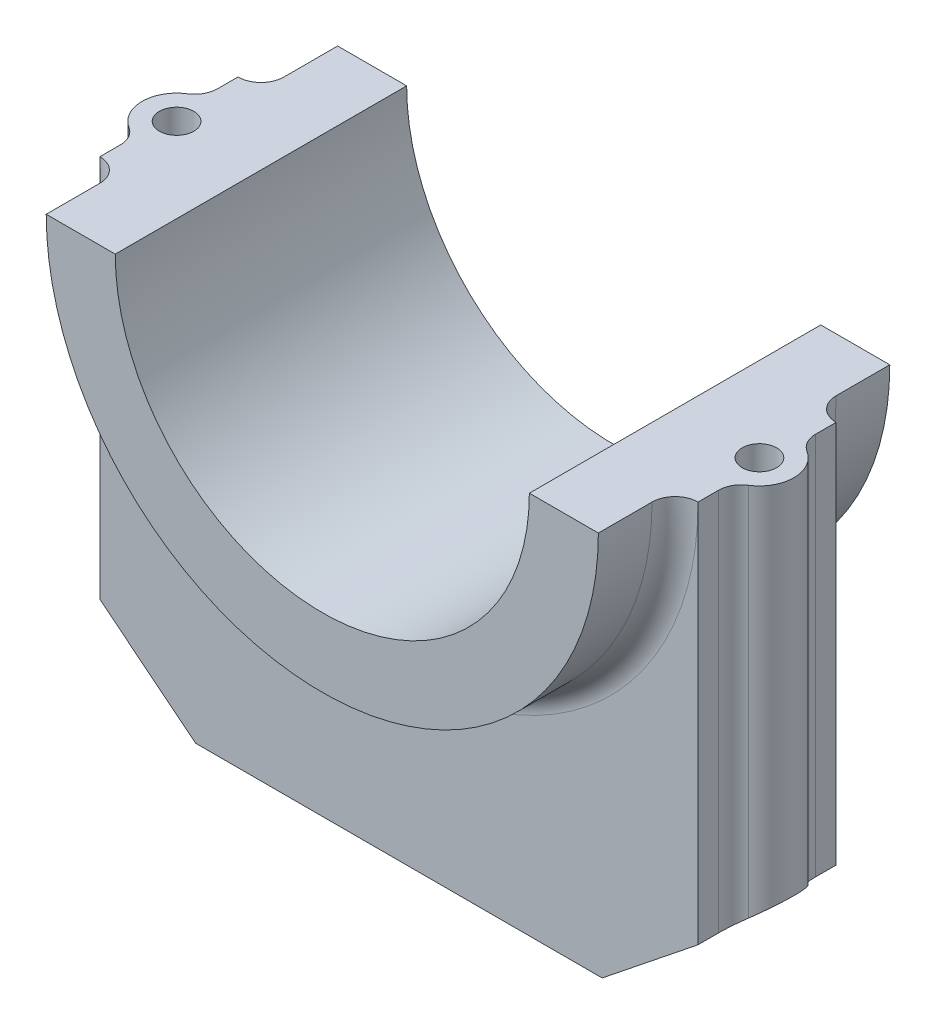
ISO-10303-21;
HEADER;
FILE_DESCRIPTION(('STEP AP214'),'2;1');
FILE_NAME('part.step','',(''),(''),'','','');
FILE_SCHEMA(('AUTOMOTIVE_DESIGN { 1 0 10303 214 1 1 1 1 }'));
ENDSEC;
DATA;
#1=APPLICATION_CONTEXT('core data for automotive mechanical design processes');
#2=APPLICATION_PROTOCOL_DEFINITION('international standard','automotive_design',2000,#1);
#3=PRODUCT_CONTEXT('',#1,'mechanical');
#4=PRODUCT('Part','Part','',(#3));
#5=PRODUCT_RELATED_PRODUCT_CATEGORY('part','',(#4));
#6=PRODUCT_DEFINITION_FORMATION('','',#4);
#7=PRODUCT_DEFINITION_CONTEXT('part definition',#1,'design');
#8=PRODUCT_DEFINITION('design','',#6,#7);
#9=PRODUCT_DEFINITION_SHAPE('','',#8);
#10=(LENGTH_UNIT() NAMED_UNIT(*) SI_UNIT(.MILLI.,.METRE.));
#11=(NAMED_UNIT(*) PLANE_ANGLE_UNIT() SI_UNIT($,.RADIAN.));
#12=(NAMED_UNIT(*) SI_UNIT($,.STERADIAN.) SOLID_ANGLE_UNIT());
#13=UNCERTAINTY_MEASURE_WITH_UNIT(LENGTH_MEASURE(1.E-05),#10,'distance_accuracy_value','');
#14=(GEOMETRIC_REPRESENTATION_CONTEXT(3) GLOBAL_UNCERTAINTY_ASSIGNED_CONTEXT((#13)) GLOBAL_UNIT_ASSIGNED_CONTEXT((#10,
#11,#12)) REPRESENTATION_CONTEXT('',''));
#15=CARTESIAN_POINT('',(0.,0.,0.));
#16=DIRECTION('',(0.,0.,1.));
#17=DIRECTION('',(1.,0.,0.));
#18=AXIS2_PLACEMENT_3D('',#15,#16,#17);
#19=CARTESIAN_POINT('',(0.,0.,19.));
#20=DIRECTION('',(0.,-1.,0.));
#21=DIRECTION('',(0.,0.,-1.));
#22=AXIS2_PLACEMENT_3D('',#19,#20,#21);
#23=PLANE('',#22);
#24=CARTESIAN_POINT('',(38.,0.,0.));
#25=DIRECTION('',(0.,1.,0.));
#26=DIRECTION('',(0.,0.,1.));
#27=AXIS2_PLACEMENT_3D('',#24,#25,#26);
#28=CIRCLE('',#27,2.25);
#29=CARTESIAN_POINT('',(38.,0.,2.25));
#30=VERTEX_POINT('',#29);
#31=EDGE_CURVE('E319',#30,#30,#28,.F.);
#32=ORIENTED_EDGE('',*,*,#31,.T.);
#33=EDGE_LOOP('',(#32));
#34=FACE_BOUND('',#33,.T.);
#35=DIRECTION('',(0.,0.,1.));
#36=VECTOR('',#35,1.);
#37=CARTESIAN_POINT('',(39.,0.,0.));
#38=LINE('',#37,#36);
#39=CARTESIAN_POINT('',(39.,0.,6.34428877022476));
#40=VERTEX_POINT('',#39);
#41=CARTESIAN_POINT('',(39.,0.,9.));
#42=VERTEX_POINT('',#41);
#43=EDGE_CURVE('E215',#40,#42,#38,.T.);
#44=ORIENTED_EDGE('',*,*,#43,.F.);
#45=CARTESIAN_POINT('',(42.,0.,6.34428877022476));
#46=DIRECTION('',(0.,-1.,0.));
#47=DIRECTION('',(0.,0.,-1.));
#48=AXIS2_PLACEMENT_3D('',#45,#46,#47);
#49=CIRCLE('',#48,3.);
#50=CARTESIAN_POINT('',(40.4,0.,3.80657326213485));
#51=VERTEX_POINT('',#50);
#52=EDGE_CURVE('E289',#40,#51,#49,.T.);
#53=ORIENTED_EDGE('',*,*,#52,.T.);
#54=CARTESIAN_POINT('',(38.,0.,0.));
#55=DIRECTION('',(0.,1.,0.));
#56=DIRECTION('',(0.,0.,1.));
#57=AXIS2_PLACEMENT_3D('',#54,#55,#56);
#58=CIRCLE('',#57,4.5);
#59=CARTESIAN_POINT('',(40.4,0.,-3.80657326213485));
#60=VERTEX_POINT('',#59);
#61=EDGE_CURVE('E225',#51,#60,#58,.T.);
#62=ORIENTED_EDGE('',*,*,#61,.T.);
#63=CARTESIAN_POINT('',(42.,0.,-6.34428877022476));
#64=DIRECTION('',(0.,-1.,0.));
#65=DIRECTION('',(0.,0.,-1.));
#66=AXIS2_PLACEMENT_3D('',#63,#64,#65);
#67=CIRCLE('',#66,3.);
#68=CARTESIAN_POINT('',(39.,0.,-6.34428877022476));
#69=VERTEX_POINT('',#68);
#70=EDGE_CURVE('E87',#60,#69,#67,.T.);
#71=ORIENTED_EDGE('',*,*,#70,.T.);
#72=CARTESIAN_POINT('',(39.,0.,-9.));
#73=VERTEX_POINT('',#72);
#74=EDGE_CURVE('E224',#73,#69,#38,.T.);
#75=ORIENTED_EDGE('',*,*,#74,.F.);
#76=CARTESIAN_POINT('',(39.,0.,-12.));
#77=DIRECTION('',(0.,-1.,0.));
#78=DIRECTION('',(0.,0.,-1.));
#79=AXIS2_PLACEMENT_3D('',#76,#77,#78);
#80=CIRCLE('',#79,3.);
#81=CARTESIAN_POINT('',(36.,0.,-12.));
#82=VERTEX_POINT('',#81);
#83=EDGE_CURVE('E262',#73,#82,#80,.T.);
#84=ORIENTED_EDGE('',*,*,#83,.T.);
#85=DIRECTION('',(0.,0.,-1.));
#86=VECTOR('',#85,1.);
#87=CARTESIAN_POINT('',(36.,0.,19.));
#88=LINE('',#87,#86);
#89=CARTESIAN_POINT('',(36.,0.,-19.));
#90=VERTEX_POINT('',#89);
#91=EDGE_CURVE('E387',#82,#90,#88,.T.);
#92=ORIENTED_EDGE('',*,*,#91,.T.);
#93=DIRECTION('',(-1.,0.,0.));
#94=VECTOR('',#93,1.);
#95=CARTESIAN_POINT('',(0.,0.,-19.));
#96=LINE('',#95,#94);
#97=CARTESIAN_POINT('',(27.,0.,-19.));
#98=VERTEX_POINT('',#97);
#99=EDGE_CURVE('E372',#90,#98,#96,.T.);
#100=ORIENTED_EDGE('',*,*,#99,.T.);
#101=DIRECTION('',(0.,0.,-1.));
#102=VECTOR('',#101,1.);
#103=CARTESIAN_POINT('',(27.,0.,19.));
#104=LINE('',#103,#102);
#105=CARTESIAN_POINT('',(27.,0.,19.));
#106=VERTEX_POINT('',#105);
#107=EDGE_CURVE('E384',#106,#98,#104,.T.);
#108=ORIENTED_EDGE('',*,*,#107,.F.);
#109=DIRECTION('',(-1.,0.,0.));
#110=VECTOR('',#109,1.);
#111=CARTESIAN_POINT('',(0.,0.,19.));
#112=LINE('',#111,#110);
#113=CARTESIAN_POINT('',(36.,0.,19.));
#114=VERTEX_POINT('',#113);
#115=EDGE_CURVE('E362',#114,#106,#112,.T.);
#116=ORIENTED_EDGE('',*,*,#115,.F.);
#117=CARTESIAN_POINT('',(36.,0.,12.));
#118=VERTEX_POINT('',#117);
#119=EDGE_CURVE('E242',#114,#118,#88,.T.);
#120=ORIENTED_EDGE('',*,*,#119,.T.);
#121=CARTESIAN_POINT('',(39.,0.,12.));
#122=DIRECTION('',(0.,-1.,0.));
#123=DIRECTION('',(0.,0.,-1.));
#124=AXIS2_PLACEMENT_3D('',#121,#122,#123);
#125=CIRCLE('',#124,3.);
#126=EDGE_CURVE('E240',#118,#42,#125,.T.);
#127=ORIENTED_EDGE('',*,*,#126,.T.);
#128=EDGE_LOOP('',(#44,#53,#62,#71,#75,#84,#92,#100,#108,#116,#120,#127));
#129=FACE_BOUND('',#128,.T.);
#130=ADVANCED_FACE('F79',(#34,#129),#23,.F.);
#131=CARTESIAN_POINT('',(0.,0.,19.));
#132=DIRECTION('',(0.,-1.,0.));
#133=DIRECTION('',(0.,0.,-1.));
#134=AXIS2_PLACEMENT_3D('',#131,#132,#133);
#135=PLANE('',#134);
#136=CARTESIAN_POINT('',(-38.,0.,0.));
#137=DIRECTION('',(0.,1.,0.));
#138=DIRECTION('',(0.,0.,1.));
#139=AXIS2_PLACEMENT_3D('',#136,#137,#138);
#140=CIRCLE('',#139,4.5);
#141=CARTESIAN_POINT('',(-40.4,0.,3.80657326213485));
#142=VERTEX_POINT('',#141);
#143=CARTESIAN_POINT('',(-40.4,0.,-3.80657326213485));
#144=VERTEX_POINT('',#143);
#145=EDGE_CURVE('E328',#142,#144,#140,.F.);
#146=ORIENTED_EDGE('',*,*,#145,.F.);
#147=CARTESIAN_POINT('',(-42.,0.,6.34428877022476));
#148=DIRECTION('',(0.,-1.,0.));
#149=DIRECTION('',(0.,0.,-1.));
#150=AXIS2_PLACEMENT_3D('',#147,#148,#149);
#151=CIRCLE('',#150,3.);
#152=CARTESIAN_POINT('',(-39.,0.,6.34428877022476));
#153=VERTEX_POINT('',#152);
#154=EDGE_CURVE('E285',#142,#153,#151,.T.);
#155=ORIENTED_EDGE('',*,*,#154,.T.);
#156=DIRECTION('',(0.,0.,1.));
#157=VECTOR('',#156,1.);
#158=CARTESIAN_POINT('',(-39.,0.,0.));
#159=LINE('',#158,#157);
#160=CARTESIAN_POINT('',(-39.,0.,9.));
#161=VERTEX_POINT('',#160);
#162=EDGE_CURVE('E326',#153,#161,#159,.T.);
#163=ORIENTED_EDGE('',*,*,#162,.T.);
#164=CARTESIAN_POINT('',(-39.,0.,12.));
#165=DIRECTION('',(0.,-1.,0.));
#166=DIRECTION('',(0.,0.,-1.));
#167=AXIS2_PLACEMENT_3D('',#164,#165,#166);
#168=CIRCLE('',#167,3.);
#169=CARTESIAN_POINT('',(-36.,0.,12.));
#170=VERTEX_POINT('',#169);
#171=EDGE_CURVE('E246',#161,#170,#168,.T.);
#172=ORIENTED_EDGE('',*,*,#171,.T.);
#173=DIRECTION('',(0.,0.,-1.));
#174=VECTOR('',#173,1.);
#175=CARTESIAN_POINT('',(-36.,0.,19.));
#176=LINE('',#175,#174);
#177=CARTESIAN_POINT('',(-36.,0.,19.));
#178=VERTEX_POINT('',#177);
#179=EDGE_CURVE('E378',#178,#170,#176,.T.);
#180=ORIENTED_EDGE('',*,*,#179,.F.);
#181=DIRECTION('',(-1.,0.,0.));
#182=VECTOR('',#181,1.);
#183=CARTESIAN_POINT('',(0.,0.,19.));
#184=LINE('',#183,#182);
#185=CARTESIAN_POINT('',(-27.,0.,19.));
#186=VERTEX_POINT('',#185);
#187=EDGE_CURVE('E367',#186,#178,#184,.T.);
#188=ORIENTED_EDGE('',*,*,#187,.F.);
#189=DIRECTION('',(0.,0.,-1.));
#190=VECTOR('',#189,1.);
#191=CARTESIAN_POINT('',(-27.,0.,19.));
#192=LINE('',#191,#190);
#193=CARTESIAN_POINT('',(-27.,0.,-19.));
#194=VERTEX_POINT('',#193);
#195=EDGE_CURVE('E381',#186,#194,#192,.T.);
#196=ORIENTED_EDGE('',*,*,#195,.T.);
#197=DIRECTION('',(-1.,0.,0.));
#198=VECTOR('',#197,1.);
#199=CARTESIAN_POINT('',(0.,0.,-19.));
#200=LINE('',#199,#198);
#201=CARTESIAN_POINT('',(-36.,0.,-19.));
#202=VERTEX_POINT('',#201);
#203=EDGE_CURVE('E363',#194,#202,#200,.T.);
#204=ORIENTED_EDGE('',*,*,#203,.T.);
#205=CARTESIAN_POINT('',(-36.,0.,-12.));
#206=VERTEX_POINT('',#205);
#207=EDGE_CURVE('E369',#206,#202,#176,.T.);
#208=ORIENTED_EDGE('',*,*,#207,.F.);
#209=CARTESIAN_POINT('',(-39.,0.,-12.));
#210=DIRECTION('',(0.,-1.,0.));
#211=DIRECTION('',(0.,0.,-1.));
#212=AXIS2_PLACEMENT_3D('',#209,#210,#211);
#213=CIRCLE('',#212,3.);
#214=CARTESIAN_POINT('',(-39.,0.,-9.));
#215=VERTEX_POINT('',#214);
#216=EDGE_CURVE('E253',#206,#215,#213,.T.);
#217=ORIENTED_EDGE('',*,*,#216,.T.);
#218=CARTESIAN_POINT('',(-39.,0.,-6.34428877022476));
#219=VERTEX_POINT('',#218);
#220=EDGE_CURVE('E329',#215,#219,#159,.T.);
#221=ORIENTED_EDGE('',*,*,#220,.T.);
#222=CARTESIAN_POINT('',(-42.,0.,-6.34428877022476));
#223=DIRECTION('',(0.,-1.,0.));
#224=DIRECTION('',(0.,0.,-1.));
#225=AXIS2_PLACEMENT_3D('',#222,#223,#224);
#226=CIRCLE('',#225,3.);
#227=EDGE_CURVE('E281',#219,#144,#226,.T.);
#228=ORIENTED_EDGE('',*,*,#227,.T.);
#229=EDGE_LOOP('',(#146,#155,#163,#172,#180,#188,#196,#204,#208,#217,#221,#228));
#230=FACE_BOUND('',#229,.T.);
#231=CARTESIAN_POINT('',(-38.,0.,0.));
#232=DIRECTION('',(0.,1.,0.));
#233=DIRECTION('',(0.,0.,1.));
#234=AXIS2_PLACEMENT_3D('',#231,#232,#233);
#235=CIRCLE('',#234,2.25);
#236=CARTESIAN_POINT('',(-38.,0.,2.25));
#237=VERTEX_POINT('',#236);
#238=EDGE_CURVE('E315',#237,#237,#235,.T.);
#239=ORIENTED_EDGE('',*,*,#238,.F.);
#240=EDGE_LOOP('',(#239));
#241=FACE_BOUND('',#240,.T.);
#242=ADVANCED_FACE('F399',(#230,#241),#135,.F.);
#243=CARTESIAN_POINT('',(-39.609756097561,-49.5121951219512,9.));
#244=DIRECTION('',(0.624695047554424,0.78086880944303,0.));
#245=DIRECTION('',(-0.78086880944303,0.624695047554424,0.));
#246=AXIS2_PLACEMENT_3D('',#243,#244,#245);
#247=PLANE('',#246);
#248=DIRECTION('',(0.,0.,-1.));
#249=VECTOR('',#248,1.);
#250=CARTESIAN_POINT('',(-39.,-50.,0.));
#251=LINE('',#250,#249);
#252=CARTESIAN_POINT('',(-39.,-50.,9.));
#253=VERTEX_POINT('',#252);
#254=CARTESIAN_POINT('',(-39.,-50.,6.34428877022476));
#255=VERTEX_POINT('',#254);
#256=EDGE_CURVE('E323',#253,#255,#251,.T.);
#257=ORIENTED_EDGE('',*,*,#256,.T.);
#258=CARTESIAN_POINT('',(-42.,-47.6,6.34428877022476));
#259=DIRECTION('',(0.624695047554424,0.78086880944303,0.));
#260=DIRECTION('',(-0.780868809443031,0.624695047554424,0.));
#261=AXIS2_PLACEMENT_3D('',#258,#259,#260);
#262=ELLIPSE('',#261,3.84187454245971,3.);
#263=CARTESIAN_POINT('',(-40.4,-48.88,3.80657326213485));
#264=VERTEX_POINT('',#263);
#265=EDGE_CURVE('E287',#255,#264,#262,.T.);
#266=ORIENTED_EDGE('',*,*,#265,.T.);
#267=CARTESIAN_POINT('',(-38.,-50.8,0.));
#268=DIRECTION('',(0.624695047554424,0.78086880944303,0.));
#269=DIRECTION('',(-0.780868809443031,0.624695047554424,0.));
#270=AXIS2_PLACEMENT_3D('',#267,#268,#269);
#271=ELLIPSE('',#270,5.76281181368956,4.5);
#272=CARTESIAN_POINT('',(-40.4,-48.88,-3.80657326213485));
#273=VERTEX_POINT('',#272);
#274=EDGE_CURVE('E335',#273,#264,#271,.T.);
#275=ORIENTED_EDGE('',*,*,#274,.F.);
#276=CARTESIAN_POINT('',(-42.,-47.6,-6.34428877022476));
#277=DIRECTION('',(0.624695047554424,0.78086880944303,0.));
#278=DIRECTION('',(-0.780868809443031,0.624695047554424,0.));
#279=AXIS2_PLACEMENT_3D('',#276,#277,#278);
#280=ELLIPSE('',#279,3.84187454245971,3.);
#281=CARTESIAN_POINT('',(-39.,-50.,-6.34428877022476));
#282=VERTEX_POINT('',#281);
#283=EDGE_CURVE('E283',#273,#282,#280,.T.);
#284=ORIENTED_EDGE('',*,*,#283,.T.);
#285=DIRECTION('',(0.,0.,-1.));
#286=VECTOR('',#285,1.);
#287=CARTESIAN_POINT('',(-39.,-50.,0.));
#288=LINE('',#287,#286);
#289=CARTESIAN_POINT('',(-39.,-50.,-9.));
#290=VERTEX_POINT('',#289);
#291=EDGE_CURVE('E302',#282,#290,#288,.T.);
#292=ORIENTED_EDGE('',*,*,#291,.T.);
#293=DIRECTION('',(0.78086880944303,-0.624695047554424,0.));
#294=VECTOR('',#293,1.);
#295=CARTESIAN_POINT('',(-39.609756097561,-49.5121951219512,-9.));
#296=LINE('',#295,#294);
#297=CARTESIAN_POINT('',(-26.5,-60.,-9.));
#298=VERTEX_POINT('',#297);
#299=EDGE_CURVE('E341',#290,#298,#296,.T.);
#300=ORIENTED_EDGE('',*,*,#299,.T.);
#301=DIRECTION('',(0.,0.,-1.));
#302=VECTOR('',#301,1.);
#303=CARTESIAN_POINT('',(-26.5,-60.,9.));
#304=LINE('',#303,#302);
#305=CARTESIAN_POINT('',(-26.5,-60.,9.));
#306=VERTEX_POINT('',#305);
#307=EDGE_CURVE('E355',#306,#298,#304,.T.);
#308=ORIENTED_EDGE('',*,*,#307,.F.);
#309=DIRECTION('',(0.78086880944303,-0.624695047554424,0.));
#310=VECTOR('',#309,1.);
#311=CARTESIAN_POINT('',(-39.609756097561,-49.5121951219512,9.));
#312=LINE('',#311,#310);
#313=EDGE_CURVE('E342',#253,#306,#312,.T.);
#314=ORIENTED_EDGE('',*,*,#313,.F.);
#315=EDGE_LOOP('',(#257,#266,#275,#284,#292,#300,#308,#314));
#316=FACE_BOUND('',#315,.T.);
#317=CARTESIAN_POINT('',(-38.,-50.8,0.));
#318=DIRECTION('',(0.624695047554424,0.78086880944303,0.));
#319=DIRECTION('',(-0.780868809443031,0.624695047554424,0.));
#320=AXIS2_PLACEMENT_3D('',#317,#318,#319);
#321=ELLIPSE('',#320,2.88140590684478,2.25);
#322=CARTESIAN_POINT('',(-40.25,-49.,0.));
#323=VERTEX_POINT('',#322);
#324=EDGE_CURVE('E318',#323,#323,#321,.F.);
#325=ORIENTED_EDGE('',*,*,#324,.F.);
#326=EDGE_LOOP('',(#325));
#327=FACE_BOUND('',#326,.T.);
#328=ADVANCED_FACE('F427',(#316,#327),#247,.F.);
#329=CARTESIAN_POINT('',(39.609756097561,-49.5121951219512,9.));
#330=DIRECTION('',(-0.624695047554424,0.78086880944303,0.));
#331=DIRECTION('',(-0.78086880944303,-0.624695047554424,0.));
#332=AXIS2_PLACEMENT_3D('',#329,#330,#331);
#333=PLANE('',#332);
#334=CARTESIAN_POINT('',(38.,-50.8,0.));
#335=DIRECTION('',(-0.624695047554424,0.78086880944303,0.));
#336=DIRECTION('',(0.780868809443031,0.624695047554424,0.));
#337=AXIS2_PLACEMENT_3D('',#334,#335,#336);
#338=ELLIPSE('',#337,2.88140590684478,2.25);
#339=CARTESIAN_POINT('',(40.25,-49.,0.));
#340=VERTEX_POINT('',#339);
#341=EDGE_CURVE('E736',#340,#340,#338,.T.);
#342=ORIENTED_EDGE('',*,*,#341,.T.);
#343=EDGE_LOOP('',(#342));
#344=FACE_BOUND('',#343,.T.);
#345=DIRECTION('',(0.78086880944303,0.624695047554424,0.));
#346=VECTOR('',#345,1.);
#347=CARTESIAN_POINT('',(39.609756097561,-49.5121951219512,-9.));
#348=LINE('',#347,#346);
#349=CARTESIAN_POINT('',(26.5,-60.,-9.));
#350=VERTEX_POINT('',#349);
#351=CARTESIAN_POINT('',(39.,-50.,-9.));
#352=VERTEX_POINT('',#351);
#353=EDGE_CURVE('E345',#350,#352,#348,.T.);
#354=ORIENTED_EDGE('',*,*,#353,.T.);
#355=DIRECTION('',(0.,0.,-1.));
#356=VECTOR('',#355,1.);
#357=CARTESIAN_POINT('',(39.,-50.,0.));
#358=LINE('',#357,#356);
#359=CARTESIAN_POINT('',(39.,-50.,-6.34428877022476));
#360=VERTEX_POINT('',#359);
#361=EDGE_CURVE('E309',#360,#352,#358,.T.);
#362=ORIENTED_EDGE('',*,*,#361,.F.);
#363=CARTESIAN_POINT('',(42.,-47.6,-6.34428877022476));
#364=DIRECTION('',(-0.624695047554424,0.78086880944303,0.));
#365=DIRECTION('',(0.780868809443031,0.624695047554424,0.));
#366=AXIS2_PLACEMENT_3D('',#363,#364,#365);
#367=ELLIPSE('',#366,3.84187454245971,3.);
#368=CARTESIAN_POINT('',(40.4,-48.88,-3.80657326213485));
#369=VERTEX_POINT('',#368);
#370=EDGE_CURVE('E12',#360,#369,#367,.T.);
#371=ORIENTED_EDGE('',*,*,#370,.T.);
#372=CARTESIAN_POINT('',(38.,-50.8,0.));
#373=DIRECTION('',(-0.624695047554424,0.78086880944303,0.));
#374=DIRECTION('',(0.780868809443031,0.624695047554424,0.));
#375=AXIS2_PLACEMENT_3D('',#372,#373,#374);
#376=ELLIPSE('',#375,5.76281181368956,4.5);
#377=CARTESIAN_POINT('',(40.4,-48.88,3.80657326213485));
#378=VERTEX_POINT('',#377);
#379=EDGE_CURVE('E299',#369,#378,#376,.F.);
#380=ORIENTED_EDGE('',*,*,#379,.T.);
#381=CARTESIAN_POINT('',(42.,-47.6,6.34428877022476));
#382=DIRECTION('',(-0.624695047554424,0.78086880944303,0.));
#383=DIRECTION('',(0.780868809443031,0.624695047554424,0.));
#384=AXIS2_PLACEMENT_3D('',#381,#382,#383);
#385=ELLIPSE('',#384,3.84187454245971,3.);
#386=CARTESIAN_POINT('',(39.,-50.,6.34428877022476));
#387=VERTEX_POINT('',#386);
#388=EDGE_CURVE('E291',#378,#387,#385,.T.);
#389=ORIENTED_EDGE('',*,*,#388,.T.);
#390=DIRECTION('',(0.,0.,-1.));
#391=VECTOR('',#390,1.);
#392=CARTESIAN_POINT('',(39.,-50.,0.));
#393=LINE('',#392,#391);
#394=CARTESIAN_POINT('',(39.,-50.,9.));
#395=VERTEX_POINT('',#394);
#396=EDGE_CURVE('E297',#395,#387,#393,.T.);
#397=ORIENTED_EDGE('',*,*,#396,.F.);
#398=DIRECTION('',(0.78086880944303,0.624695047554424,0.));
#399=VECTOR('',#398,1.);
#400=CARTESIAN_POINT('',(39.609756097561,-49.5121951219512,9.));
#401=LINE('',#400,#399);
#402=CARTESIAN_POINT('',(26.5,-60.,9.));
#403=VERTEX_POINT('',#402);
#404=EDGE_CURVE('E235',#403,#395,#401,.T.);
#405=ORIENTED_EDGE('',*,*,#404,.F.);
#406=DIRECTION('',(0.,0.,-1.));
#407=VECTOR('',#406,1.);
#408=CARTESIAN_POINT('',(26.5,-60.,9.));
#409=LINE('',#408,#407);
#410=EDGE_CURVE('E348',#403,#350,#409,.T.);
#411=ORIENTED_EDGE('',*,*,#410,.T.);
#412=EDGE_LOOP('',(#354,#362,#371,#380,#389,#397,#405,#411));
#413=FACE_BOUND('',#412,.T.);
#414=ADVANCED_FACE('F296',(#344,#413),#333,.F.);
#415=CARTESIAN_POINT('',(0.,0.,9.));
#416=DIRECTION('',(0.,0.,1.));
#417=DIRECTION('',(1.,0.,0.));
#418=AXIS2_PLACEMENT_3D('',#415,#416,#417);
#419=PLANE('',#418);
#420=DIRECTION('',(0.,1.,0.));
#421=VECTOR('',#420,1.);
#422=CARTESIAN_POINT('',(39.,-60.001,9.));
#423=LINE('',#422,#421);
#424=EDGE_CURVE('E219',#395,#42,#423,.T.);
#425=ORIENTED_EDGE('',*,*,#424,.T.);
#426=CARTESIAN_POINT('',(0.,0.,9.));
#427=DIRECTION('',(0.,0.,1.));
#428=DIRECTION('',(1.,0.,0.));
#429=AXIS2_PLACEMENT_3D('',#426,#427,#428);
#430=CIRCLE('',#429,39.);
#431=EDGE_CURVE('E233',#42,#161,#430,.F.);
#432=ORIENTED_EDGE('',*,*,#431,.T.);
#433=DIRECTION('',(0.,1.,0.));
#434=VECTOR('',#433,1.);
#435=CARTESIAN_POINT('',(-39.,-60.001,9.));
#436=LINE('',#435,#434);
#437=EDGE_CURVE('E332',#253,#161,#436,.T.);
#438=ORIENTED_EDGE('',*,*,#437,.F.);
#439=ORIENTED_EDGE('',*,*,#313,.T.);
#440=DIRECTION('',(1.,0.,0.));
#441=VECTOR('',#440,1.);
#442=CARTESIAN_POINT('',(0.,-60.,9.));
#443=LINE('',#442,#441);
#444=EDGE_CURVE('E344',#306,#403,#443,.T.);
#445=ORIENTED_EDGE('',*,*,#444,.T.);
#446=ORIENTED_EDGE('',*,*,#404,.T.);
#447=EDGE_LOOP('',(#425,#432,#438,#439,#445,#446));
#448=FACE_BOUND('',#447,.T.);
#449=ADVANCED_FACE('F230',(#448),#419,.T.);
#450=CARTESIAN_POINT('',(0.,0.,-9.));
#451=DIRECTION('',(0.,0.,1.));
#452=DIRECTION('',(1.,0.,0.));
#453=AXIS2_PLACEMENT_3D('',#450,#451,#452);
#454=PLANE('',#453);
#455=CARTESIAN_POINT('',(0.,0.,-9.));
#456=DIRECTION('',(0.,0.,1.));
#457=DIRECTION('',(1.,0.,0.));
#458=AXIS2_PLACEMENT_3D('',#455,#456,#457);
#459=CIRCLE('',#458,39.);
#460=EDGE_CURVE('E251',#215,#73,#459,.T.);
#461=ORIENTED_EDGE('',*,*,#460,.T.);
#462=DIRECTION('',(0.,1.,0.));
#463=VECTOR('',#462,1.);
#464=CARTESIAN_POINT('',(39.,-60.001,-9.));
#465=LINE('',#464,#463);
#466=EDGE_CURVE('E236',#352,#73,#465,.T.);
#467=ORIENTED_EDGE('',*,*,#466,.F.);
#468=ORIENTED_EDGE('',*,*,#353,.F.);
#469=DIRECTION('',(1.,0.,0.));
#470=VECTOR('',#469,1.);
#471=CARTESIAN_POINT('',(0.,-60.,-9.));
#472=LINE('',#471,#470);
#473=EDGE_CURVE('E350',#298,#350,#472,.T.);
#474=ORIENTED_EDGE('',*,*,#473,.F.);
#475=ORIENTED_EDGE('',*,*,#299,.F.);
#476=DIRECTION('',(0.,1.,0.));
#477=VECTOR('',#476,1.);
#478=CARTESIAN_POINT('',(-39.,-60.001,-9.));
#479=LINE('',#478,#477);
#480=EDGE_CURVE('E336',#290,#215,#479,.T.);
#481=ORIENTED_EDGE('',*,*,#480,.T.);
#482=EDGE_LOOP('',(#461,#467,#468,#474,#475,#481));
#483=FACE_BOUND('',#482,.T.);
#484=ADVANCED_FACE('F439',(#483),#454,.F.);
#485=CARTESIAN_POINT('',(0.,0.,19.));
#486=DIRECTION('',(0.,0.,-1.));
#487=DIRECTION('',(-1.,0.,0.));
#488=AXIS2_PLACEMENT_3D('',#485,#486,#487);
#489=CYLINDRICAL_SURFACE('',#488,36.);
#490=ORIENTED_EDGE('',*,*,#91,.F.);
#491=CARTESIAN_POINT('',(0.,0.,-12.));
#492=DIRECTION('',(0.,0.,1.));
#493=DIRECTION('',(1.,0.,0.));
#494=AXIS2_PLACEMENT_3D('',#491,#492,#493);
#495=CIRCLE('',#494,36.);
#496=EDGE_CURVE('E256',#82,#206,#495,.F.);
#497=ORIENTED_EDGE('',*,*,#496,.T.);
#498=ORIENTED_EDGE('',*,*,#207,.T.);
#499=CARTESIAN_POINT('',(0.,0.,-19.));
#500=DIRECTION('',(0.,0.,1.));
#501=DIRECTION('',(1.,0.,0.));
#502=AXIS2_PLACEMENT_3D('',#499,#500,#501);
#503=CIRCLE('',#502,36.);
#504=EDGE_CURVE('E358',#90,#202,#503,.F.);
#505=ORIENTED_EDGE('',*,*,#504,.F.);
#506=EDGE_LOOP('',(#490,#497,#498,#505));
#507=FACE_BOUND('',#506,.T.);
#508=ADVANCED_FACE('F393',(#507),#489,.T.);
#509=ORIENTED_EDGE('',*,*,#179,.T.);
#510=CARTESIAN_POINT('',(0.,0.,12.));
#511=DIRECTION('',(0.,0.,1.));
#512=DIRECTION('',(1.,0.,0.));
#513=AXIS2_PLACEMENT_3D('',#510,#511,#512);
#514=CIRCLE('',#513,36.);
#515=EDGE_CURVE('E250',#170,#118,#514,.T.);
#516=ORIENTED_EDGE('',*,*,#515,.T.);
#517=ORIENTED_EDGE('',*,*,#119,.F.);
#518=CARTESIAN_POINT('',(0.,0.,19.));
#519=DIRECTION('',(0.,0.,1.));
#520=DIRECTION('',(1.,0.,0.));
#521=AXIS2_PLACEMENT_3D('',#518,#519,#520);
#522=CIRCLE('',#521,36.);
#523=EDGE_CURVE('E359',#114,#178,#522,.F.);
#524=ORIENTED_EDGE('',*,*,#523,.T.);
#525=EDGE_LOOP('',(#509,#516,#517,#524));
#526=FACE_BOUND('',#525,.T.);
#527=ADVANCED_FACE('F419',(#526),#489,.T.);
#528=CARTESIAN_POINT('',(0.,0.,19.));
#529=DIRECTION('',(0.,0.,-1.));
#530=DIRECTION('',(-1.,0.,0.));
#531=AXIS2_PLACEMENT_3D('',#528,#529,#530);
#532=CYLINDRICAL_SURFACE('',#531,27.);
#533=CARTESIAN_POINT('',(0.,0.,-19.));
#534=DIRECTION('',(0.,0.,1.));
#535=DIRECTION('',(1.,0.,0.));
#536=AXIS2_PLACEMENT_3D('',#533,#534,#535);
#537=CIRCLE('',#536,27.);
#538=EDGE_CURVE('E374',#98,#194,#537,.F.);
#539=ORIENTED_EDGE('',*,*,#538,.T.);
#540=ORIENTED_EDGE('',*,*,#195,.F.);
#541=CARTESIAN_POINT('',(0.,0.,19.));
#542=DIRECTION('',(0.,0.,1.));
#543=DIRECTION('',(1.,0.,0.));
#544=AXIS2_PLACEMENT_3D('',#541,#542,#543);
#545=CIRCLE('',#544,27.);
#546=EDGE_CURVE('E365',#106,#186,#545,.F.);
#547=ORIENTED_EDGE('',*,*,#546,.F.);
#548=ORIENTED_EDGE('',*,*,#107,.T.);
#549=EDGE_LOOP('',(#539,#540,#547,#548));
#550=FACE_BOUND('',#549,.T.);
#551=ADVANCED_FACE('F413',(#550),#532,.F.);
#552=CARTESIAN_POINT('',(0.,0.,19.));
#553=DIRECTION('',(0.,0.,1.));
#554=DIRECTION('',(1.,0.,0.));
#555=AXIS2_PLACEMENT_3D('',#552,#553,#554);
#556=PLANE('',#555);
#557=ORIENTED_EDGE('',*,*,#523,.F.);
#558=ORIENTED_EDGE('',*,*,#115,.T.);
#559=ORIENTED_EDGE('',*,*,#546,.T.);
#560=ORIENTED_EDGE('',*,*,#187,.T.);
#561=EDGE_LOOP('',(#557,#558,#559,#560));
#562=FACE_BOUND('',#561,.T.);
#563=ADVANCED_FACE('F416',(#562),#556,.T.);
#564=CARTESIAN_POINT('',(0.,0.,-19.));
#565=DIRECTION('',(0.,0.,1.));
#566=DIRECTION('',(1.,0.,0.));
#567=AXIS2_PLACEMENT_3D('',#564,#565,#566);
#568=PLANE('',#567);
#569=ORIENTED_EDGE('',*,*,#504,.T.);
#570=ORIENTED_EDGE('',*,*,#203,.F.);
#571=ORIENTED_EDGE('',*,*,#538,.F.);
#572=ORIENTED_EDGE('',*,*,#99,.F.);
#573=EDGE_LOOP('',(#569,#570,#571,#572));
#574=FACE_BOUND('',#573,.T.);
#575=ADVANCED_FACE('F409',(#574),#568,.F.);
#576=CARTESIAN_POINT('',(0.,-60.,9.));
#577=DIRECTION('',(0.,1.,0.));
#578=DIRECTION('',(0.,0.,1.));
#579=AXIS2_PLACEMENT_3D('',#576,#577,#578);
#580=PLANE('',#579);
#581=ORIENTED_EDGE('',*,*,#473,.T.);
#582=ORIENTED_EDGE('',*,*,#410,.F.);
#583=ORIENTED_EDGE('',*,*,#444,.F.);
#584=ORIENTED_EDGE('',*,*,#307,.T.);
#585=EDGE_LOOP('',(#581,#582,#583,#584));
#586=FACE_BOUND('',#585,.T.);
#587=ADVANCED_FACE('F435',(#586),#580,.F.);
#588=CARTESIAN_POINT('',(0.,0.,-12.));
#589=DIRECTION('',(0.,0.,1.));
#590=DIRECTION('',(1.,0.,0.));
#591=AXIS2_PLACEMENT_3D('',#588,#589,#590);
#592=TOROIDAL_SURFACE('',#591,39.,3.);
#593=ORIENTED_EDGE('',*,*,#83,.F.);
#594=ORIENTED_EDGE('',*,*,#460,.F.);
#595=ORIENTED_EDGE('',*,*,#216,.F.);
#596=ORIENTED_EDGE('',*,*,#496,.F.);
#597=EDGE_LOOP('',(#593,#594,#595,#596));
#598=FACE_BOUND('',#597,.T.);
#599=ADVANCED_FACE('F441',(#598),#592,.F.);
#600=CARTESIAN_POINT('',(0.,0.,12.));
#601=DIRECTION('',(0.,0.,1.));
#602=DIRECTION('',(1.,0.,0.));
#603=AXIS2_PLACEMENT_3D('',#600,#601,#602);
#604=TOROIDAL_SURFACE('',#603,39.,3.);
#605=ORIENTED_EDGE('',*,*,#126,.F.);
#606=ORIENTED_EDGE('',*,*,#515,.F.);
#607=ORIENTED_EDGE('',*,*,#171,.F.);
#608=ORIENTED_EDGE('',*,*,#431,.F.);
#609=EDGE_LOOP('',(#605,#606,#607,#608));
#610=FACE_BOUND('',#609,.T.);
#611=ADVANCED_FACE('F249',(#610),#604,.F.);
#612=CARTESIAN_POINT('',(-39.,-60.001,0.));
#613=DIRECTION('',(-1.,0.,0.));
#614=DIRECTION('',(0.,0.,1.));
#615=AXIS2_PLACEMENT_3D('',#612,#613,#614);
#616=PLANE('',#615);
#617=ORIENTED_EDGE('',*,*,#162,.F.);
#618=DIRECTION('',(0.,1.,0.));
#619=VECTOR('',#618,1.);
#620=CARTESIAN_POINT('',(-39.,-60.001,6.34428877022476));
#621=LINE('',#620,#619);
#622=EDGE_CURVE('E272',#153,#255,#621,.F.);
#623=ORIENTED_EDGE('',*,*,#622,.T.);
#624=ORIENTED_EDGE('',*,*,#256,.F.);
#625=ORIENTED_EDGE('',*,*,#437,.T.);
#626=EDGE_LOOP('',(#617,#623,#624,#625));
#627=FACE_BOUND('',#626,.T.);
#628=ADVANCED_FACE('F423',(#627),#616,.T.);
#629=ORIENTED_EDGE('',*,*,#291,.F.);
#630=DIRECTION('',(0.,1.,0.));
#631=VECTOR('',#630,1.);
#632=CARTESIAN_POINT('',(-39.,-60.001,-6.34428877022476));
#633=LINE('',#632,#631);
#634=EDGE_CURVE('E245',#282,#219,#633,.T.);
#635=ORIENTED_EDGE('',*,*,#634,.T.);
#636=ORIENTED_EDGE('',*,*,#220,.F.);
#637=ORIENTED_EDGE('',*,*,#480,.F.);
#638=EDGE_LOOP('',(#629,#635,#636,#637));
#639=FACE_BOUND('',#638,.T.);
#640=ADVANCED_FACE('F629',(#639),#616,.T.);
#641=CARTESIAN_POINT('',(-38.,-60.001,0.));
#642=DIRECTION('',(0.,1.,0.));
#643=DIRECTION('',(0.,0.,1.));
#644=AXIS2_PLACEMENT_3D('',#641,#642,#643);
#645=CYLINDRICAL_SURFACE('',#644,4.5);
#646=ORIENTED_EDGE('',*,*,#145,.T.);
#647=DIRECTION('',(0.,1.,0.));
#648=VECTOR('',#647,1.);
#649=CARTESIAN_POINT('',(-40.4,-60.001,-3.80657326213485));
#650=LINE('',#649,#648);
#651=EDGE_CURVE('E270',#144,#273,#650,.F.);
#652=ORIENTED_EDGE('',*,*,#651,.T.);
#653=ORIENTED_EDGE('',*,*,#274,.T.);
#654=DIRECTION('',(0.,1.,0.));
#655=VECTOR('',#654,1.);
#656=CARTESIAN_POINT('',(-40.4,-60.001,3.80657326213485));
#657=LINE('',#656,#655);
#658=EDGE_CURVE('E267',#264,#142,#657,.T.);
#659=ORIENTED_EDGE('',*,*,#658,.T.);
#660=EDGE_LOOP('',(#646,#652,#653,#659));
#661=FACE_BOUND('',#660,.T.);
#662=ADVANCED_FACE('F620',(#661),#645,.T.);
#663=CARTESIAN_POINT('',(38.,-60.001,0.));
#664=DIRECTION('',(0.,1.,0.));
#665=DIRECTION('',(0.,0.,1.));
#666=AXIS2_PLACEMENT_3D('',#663,#664,#665);
#667=CYLINDRICAL_SURFACE('',#666,4.5);
#668=ORIENTED_EDGE('',*,*,#61,.F.);
#669=DIRECTION('',(0.,1.,0.));
#670=VECTOR('',#669,1.);
#671=CARTESIAN_POINT('',(40.4,-60.001,3.80657326213485));
#672=LINE('',#671,#670);
#673=EDGE_CURVE('E278',#51,#378,#672,.F.);
#674=ORIENTED_EDGE('',*,*,#673,.T.);
#675=ORIENTED_EDGE('',*,*,#379,.F.);
#676=DIRECTION('',(0.,1.,0.));
#677=VECTOR('',#676,1.);
#678=CARTESIAN_POINT('',(40.4,-60.001,-3.80657326213485));
#679=LINE('',#678,#677);
#680=EDGE_CURVE('E275',#369,#60,#679,.T.);
#681=ORIENTED_EDGE('',*,*,#680,.T.);
#682=EDGE_LOOP('',(#668,#674,#675,#681));
#683=FACE_BOUND('',#682,.T.);
#684=ADVANCED_FACE('F307',(#683),#667,.T.);
#685=CARTESIAN_POINT('',(39.,-60.001,0.));
#686=DIRECTION('',(-1.,0.,0.));
#687=DIRECTION('',(0.,0.,1.));
#688=AXIS2_PLACEMENT_3D('',#685,#686,#687);
#689=PLANE('',#688);
#690=ORIENTED_EDGE('',*,*,#74,.T.);
#691=DIRECTION('',(0.,1.,0.));
#692=VECTOR('',#691,1.);
#693=CARTESIAN_POINT('',(39.,-60.001,-6.34428877022476));
#694=LINE('',#693,#692);
#695=EDGE_CURVE('E100',#69,#360,#694,.F.);
#696=ORIENTED_EDGE('',*,*,#695,.T.);
#697=ORIENTED_EDGE('',*,*,#361,.T.);
#698=ORIENTED_EDGE('',*,*,#466,.T.);
#699=EDGE_LOOP('',(#690,#696,#697,#698));
#700=FACE_BOUND('',#699,.T.);
#701=ADVANCED_FACE('F440',(#700),#689,.F.);
#702=ORIENTED_EDGE('',*,*,#396,.T.);
#703=DIRECTION('',(0.,1.,0.));
#704=VECTOR('',#703,1.);
#705=CARTESIAN_POINT('',(39.,-60.001,6.34428877022476));
#706=LINE('',#705,#704);
#707=EDGE_CURVE('E222',#387,#40,#706,.T.);
#708=ORIENTED_EDGE('',*,*,#707,.T.);
#709=ORIENTED_EDGE('',*,*,#43,.T.);
#710=ORIENTED_EDGE('',*,*,#424,.F.);
#711=EDGE_LOOP('',(#702,#708,#709,#710));
#712=FACE_BOUND('',#711,.T.);
#713=ADVANCED_FACE('F218',(#712),#689,.F.);
#714=CARTESIAN_POINT('',(38.,-60.001,0.));
#715=DIRECTION('',(0.,1.,0.));
#716=DIRECTION('',(0.,0.,1.));
#717=AXIS2_PLACEMENT_3D('',#714,#715,#716);
#718=CYLINDRICAL_SURFACE('',#717,2.25);
#719=ORIENTED_EDGE('',*,*,#31,.F.);
#720=EDGE_LOOP('',(#719));
#721=FACE_BOUND('',#720,.T.);
#722=ORIENTED_EDGE('',*,*,#341,.F.);
#723=EDGE_LOOP('',(#722));
#724=FACE_BOUND('',#723,.T.);
#725=ADVANCED_FACE('F535',(#721,#724),#718,.F.);
#726=CARTESIAN_POINT('',(-38.,-60.001,0.));
#727=DIRECTION('',(0.,1.,0.));
#728=DIRECTION('',(0.,0.,1.));
#729=AXIS2_PLACEMENT_3D('',#726,#727,#728);
#730=CYLINDRICAL_SURFACE('',#729,2.25);
#731=ORIENTED_EDGE('',*,*,#238,.T.);
#732=EDGE_LOOP('',(#731));
#733=FACE_BOUND('',#732,.T.);
#734=ORIENTED_EDGE('',*,*,#324,.T.);
#735=EDGE_LOOP('',(#734));
#736=FACE_BOUND('',#735,.T.);
#737=ADVANCED_FACE('F539',(#733,#736),#730,.F.);
#738=CARTESIAN_POINT('',(-42.,-60.001,-6.34428877022476));
#739=DIRECTION('',(0.,1.,0.));
#740=DIRECTION('',(0.,0.,1.));
#741=AXIS2_PLACEMENT_3D('',#738,#739,#740);
#742=CYLINDRICAL_SURFACE('',#741,3.);
#743=ORIENTED_EDGE('',*,*,#283,.F.);
#744=ORIENTED_EDGE('',*,*,#651,.F.);
#745=ORIENTED_EDGE('',*,*,#227,.F.);
#746=ORIENTED_EDGE('',*,*,#634,.F.);
#747=EDGE_LOOP('',(#743,#744,#745,#746));
#748=FACE_BOUND('',#747,.T.);
#749=ADVANCED_FACE('F551',(#748),#742,.F.);
#750=CARTESIAN_POINT('',(-42.,-60.001,6.34428877022476));
#751=DIRECTION('',(0.,1.,0.));
#752=DIRECTION('',(0.,0.,1.));
#753=AXIS2_PLACEMENT_3D('',#750,#751,#752);
#754=CYLINDRICAL_SURFACE('',#753,3.);
#755=ORIENTED_EDGE('',*,*,#265,.F.);
#756=ORIENTED_EDGE('',*,*,#622,.F.);
#757=ORIENTED_EDGE('',*,*,#154,.F.);
#758=ORIENTED_EDGE('',*,*,#658,.F.);
#759=EDGE_LOOP('',(#755,#756,#757,#758));
#760=FACE_BOUND('',#759,.T.);
#761=ADVANCED_FACE('F563',(#760),#754,.F.);
#762=CARTESIAN_POINT('',(42.,-60.001,6.34428877022476));
#763=DIRECTION('',(0.,1.,0.));
#764=DIRECTION('',(0.,0.,1.));
#765=AXIS2_PLACEMENT_3D('',#762,#763,#764);
#766=CYLINDRICAL_SURFACE('',#765,3.);
#767=ORIENTED_EDGE('',*,*,#388,.F.);
#768=ORIENTED_EDGE('',*,*,#673,.F.);
#769=ORIENTED_EDGE('',*,*,#52,.F.);
#770=ORIENTED_EDGE('',*,*,#707,.F.);
#771=EDGE_LOOP('',(#767,#768,#769,#770));
#772=FACE_BOUND('',#771,.T.);
#773=ADVANCED_FACE('F304',(#772),#766,.F.);
#774=CARTESIAN_POINT('',(42.,-60.001,-6.34428877022476));
#775=DIRECTION('',(0.,1.,0.));
#776=DIRECTION('',(0.,0.,1.));
#777=AXIS2_PLACEMENT_3D('',#774,#775,#776);
#778=CYLINDRICAL_SURFACE('',#777,3.);
#779=ORIENTED_EDGE('',*,*,#370,.F.);
#780=ORIENTED_EDGE('',*,*,#695,.F.);
#781=ORIENTED_EDGE('',*,*,#70,.F.);
#782=ORIENTED_EDGE('',*,*,#680,.F.);
#783=EDGE_LOOP('',(#779,#780,#781,#782));
#784=FACE_BOUND('',#783,.T.);
#785=ADVANCED_FACE('F81',(#784),#778,.F.);
#786=CLOSED_SHELL('',(#130,#242,#328,#414,#449,#484,#508,#527,#551,#563,#575,#587,#599,#611,
#628,#640,#662,#684,#701,#713,#725,#737,#749,#761,#773,#785));
#787=MANIFOLD_SOLID_BREP('B2',#786);
#788=ADVANCED_BREP_SHAPE_REPRESENTATION('',(#18,#787),#14);
#789=SHAPE_DEFINITION_REPRESENTATION(#9,#788);
ENDSEC;
END-ISO-10303-21;
